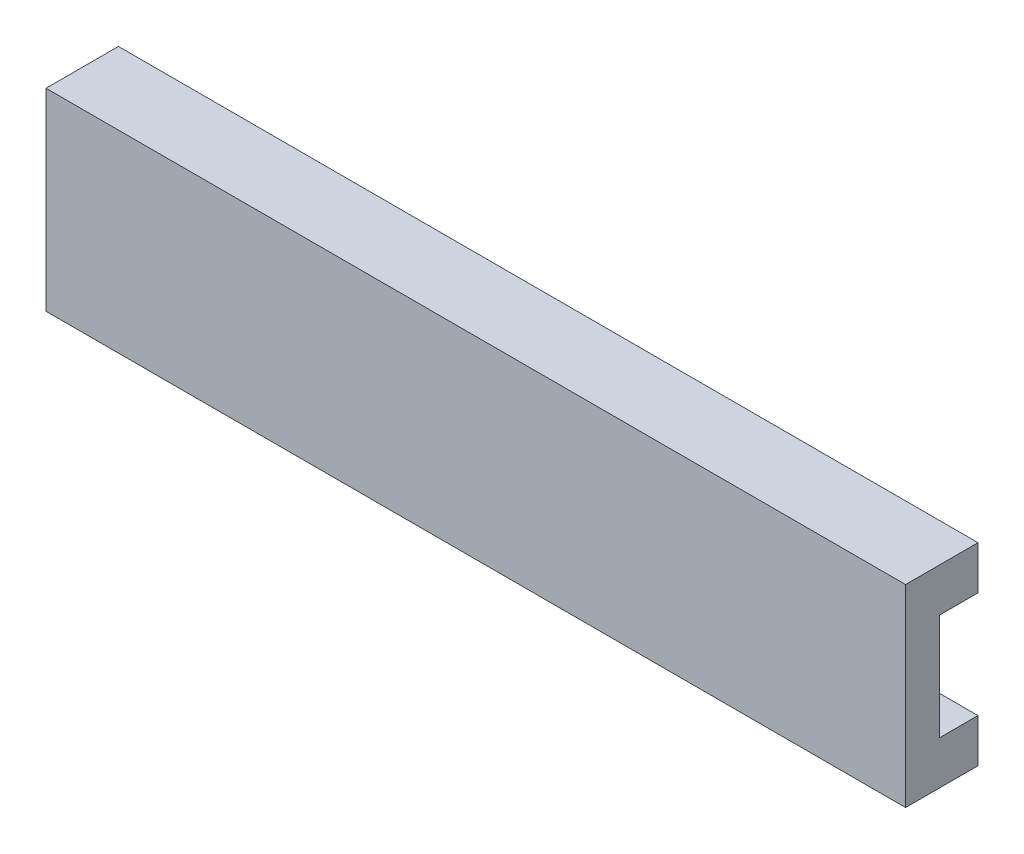
ISO-10303-21;
HEADER;
FILE_DESCRIPTION(('STEP AP214'),'2;1');
FILE_NAME('part.step','',(''),(''),'','','');
FILE_SCHEMA(('AUTOMOTIVE_DESIGN { 1 0 10303 214 1 1 1 1 }'));
ENDSEC;
DATA;
#1=APPLICATION_CONTEXT('core data for automotive mechanical design processes');
#2=APPLICATION_PROTOCOL_DEFINITION('international standard','automotive_design',2000,#1);
#3=PRODUCT_CONTEXT('',#1,'mechanical');
#4=PRODUCT('Part','Part','',(#3));
#5=PRODUCT_RELATED_PRODUCT_CATEGORY('part','',(#4));
#6=PRODUCT_DEFINITION_FORMATION('','',#4);
#7=PRODUCT_DEFINITION_CONTEXT('part definition',#1,'design');
#8=PRODUCT_DEFINITION('design','',#6,#7);
#9=PRODUCT_DEFINITION_SHAPE('','',#8);
#10=(LENGTH_UNIT() NAMED_UNIT(*) SI_UNIT(.MILLI.,.METRE.));
#11=(NAMED_UNIT(*) PLANE_ANGLE_UNIT() SI_UNIT($,.RADIAN.));
#12=(NAMED_UNIT(*) SI_UNIT($,.STERADIAN.) SOLID_ANGLE_UNIT());
#13=UNCERTAINTY_MEASURE_WITH_UNIT(LENGTH_MEASURE(1.E-05),#10,'distance_accuracy_value','');
#14=(GEOMETRIC_REPRESENTATION_CONTEXT(3) GLOBAL_UNCERTAINTY_ASSIGNED_CONTEXT((#13)) GLOBAL_UNIT_ASSIGNED_CONTEXT((#10,
#11,#12)) REPRESENTATION_CONTEXT('',''));
#15=CARTESIAN_POINT('',(0.,0.,0.));
#16=DIRECTION('',(0.,0.,1.));
#17=DIRECTION('',(1.,0.,0.));
#18=AXIS2_PLACEMENT_3D('',#15,#16,#17);
#19=CARTESIAN_POINT('',(-178.,0.,-15.));
#20=DIRECTION('',(0.,-1.,0.));
#21=DIRECTION('',(0.,0.,-1.));
#22=AXIS2_PLACEMENT_3D('',#19,#20,#21);
#23=PLANE('',#22);
#24=DIRECTION('',(0.,0.,-1.));
#25=VECTOR('',#24,1.);
#26=CARTESIAN_POINT('',(0.,0.,-15.));
#27=LINE('',#26,#25);
#28=CARTESIAN_POINT('',(0.,0.,0.));
#29=VERTEX_POINT('',#28);
#30=CARTESIAN_POINT('',(0.,0.,-15.));
#31=VERTEX_POINT('',#30);
#32=EDGE_CURVE('E130',#29,#31,#27,.T.);
#33=ORIENTED_EDGE('',*,*,#32,.F.);
#34=DIRECTION('',(1.,0.,0.));
#35=VECTOR('',#34,1.);
#36=CARTESIAN_POINT('',(-178.,0.,0.));
#37=LINE('',#36,#35);
#38=CARTESIAN_POINT('',(-178.,0.,0.));
#39=VERTEX_POINT('',#38);
#40=EDGE_CURVE('E11',#39,#29,#37,.T.);
#41=ORIENTED_EDGE('',*,*,#40,.F.);
#42=DIRECTION('',(0.,0.,-1.));
#43=VECTOR('',#42,1.);
#44=CARTESIAN_POINT('',(-178.,0.,-15.));
#45=LINE('',#44,#43);
#46=CARTESIAN_POINT('',(-178.,0.,-15.));
#47=VERTEX_POINT('',#46);
#48=EDGE_CURVE('E150',#39,#47,#45,.T.);
#49=ORIENTED_EDGE('',*,*,#48,.T.);
#50=DIRECTION('',(1.,0.,0.));
#51=VECTOR('',#50,1.);
#52=CARTESIAN_POINT('',(-178.,0.,-15.));
#53=LINE('',#52,#51);
#54=EDGE_CURVE('E36',#47,#31,#53,.T.);
#55=ORIENTED_EDGE('',*,*,#54,.T.);
#56=EDGE_LOOP('',(#33,#41,#49,#55));
#57=FACE_BOUND('',#56,.T.);
#58=ADVANCED_FACE('F33',(#57),#23,.T.);
#59=CARTESIAN_POINT('',(-178.,0.,0.));
#60=DIRECTION('',(0.,0.,1.));
#61=DIRECTION('',(1.,0.,0.));
#62=AXIS2_PLACEMENT_3D('',#59,#60,#61);
#63=PLANE('',#62);
#64=DIRECTION('',(0.,-1.,0.));
#65=VECTOR('',#64,1.);
#66=CARTESIAN_POINT('',(0.,0.,0.));
#67=LINE('',#66,#65);
#68=CARTESIAN_POINT('',(0.,40.,0.));
#69=VERTEX_POINT('',#68);
#70=EDGE_CURVE('E148',#69,#29,#67,.T.);
#71=ORIENTED_EDGE('',*,*,#70,.F.);
#72=DIRECTION('',(1.,0.,0.));
#73=VECTOR('',#72,1.);
#74=CARTESIAN_POINT('',(-178.,40.,0.));
#75=LINE('',#74,#73);
#76=CARTESIAN_POINT('',(-178.,40.,0.));
#77=VERTEX_POINT('',#76);
#78=EDGE_CURVE('E42',#77,#69,#75,.T.);
#79=ORIENTED_EDGE('',*,*,#78,.F.);
#80=DIRECTION('',(0.,-1.,0.));
#81=VECTOR('',#80,1.);
#82=CARTESIAN_POINT('',(-178.,0.,0.));
#83=LINE('',#82,#81);
#84=EDGE_CURVE('E120',#77,#39,#83,.T.);
#85=ORIENTED_EDGE('',*,*,#84,.T.);
#86=ORIENTED_EDGE('',*,*,#40,.T.);
#87=EDGE_LOOP('',(#71,#79,#85,#86));
#88=FACE_BOUND('',#87,.T.);
#89=ADVANCED_FACE('F162',(#88),#63,.T.);
#90=CARTESIAN_POINT('',(-178.,40.,0.));
#91=DIRECTION('',(0.,1.,0.));
#92=DIRECTION('',(0.,0.,1.));
#93=AXIS2_PLACEMENT_3D('',#90,#91,#92);
#94=PLANE('',#93);
#95=DIRECTION('',(0.,0.,1.));
#96=VECTOR('',#95,1.);
#97=CARTESIAN_POINT('',(0.,40.,0.));
#98=LINE('',#97,#96);
#99=CARTESIAN_POINT('',(0.,40.,-15.));
#100=VERTEX_POINT('',#99);
#101=EDGE_CURVE('E107',#100,#69,#98,.T.);
#102=ORIENTED_EDGE('',*,*,#101,.F.);
#103=DIRECTION('',(1.,0.,0.));
#104=VECTOR('',#103,1.);
#105=CARTESIAN_POINT('',(-178.,40.,-15.));
#106=LINE('',#105,#104);
#107=CARTESIAN_POINT('',(-178.,40.,-15.));
#108=VERTEX_POINT('',#107);
#109=EDGE_CURVE('E102',#108,#100,#106,.T.);
#110=ORIENTED_EDGE('',*,*,#109,.F.);
#111=DIRECTION('',(0.,0.,1.));
#112=VECTOR('',#111,1.);
#113=CARTESIAN_POINT('',(-178.,40.,0.));
#114=LINE('',#113,#112);
#115=EDGE_CURVE('E105',#108,#77,#114,.T.);
#116=ORIENTED_EDGE('',*,*,#115,.T.);
#117=ORIENTED_EDGE('',*,*,#78,.T.);
#118=EDGE_LOOP('',(#102,#110,#116,#117));
#119=FACE_BOUND('',#118,.T.);
#120=ADVANCED_FACE('F104',(#119),#94,.T.);
#121=CARTESIAN_POINT('',(-178.,40.,-15.));
#122=DIRECTION('',(0.,0.,-1.));
#123=DIRECTION('',(0.,1.,0.));
#124=AXIS2_PLACEMENT_3D('',#121,#122,#123);
#125=PLANE('',#124);
#126=DIRECTION('',(0.,1.,0.));
#127=VECTOR('',#126,1.);
#128=CARTESIAN_POINT('',(0.,40.,-15.));
#129=LINE('',#128,#127);
#130=CARTESIAN_POINT('',(0.,31.,-15.));
#131=VERTEX_POINT('',#130);
#132=EDGE_CURVE('E145',#131,#100,#129,.T.);
#133=ORIENTED_EDGE('',*,*,#132,.F.);
#134=DIRECTION('',(1.,0.,0.));
#135=VECTOR('',#134,1.);
#136=CARTESIAN_POINT('',(-178.,31.,-15.));
#137=LINE('',#136,#135);
#138=CARTESIAN_POINT('',(-178.,31.,-15.));
#139=VERTEX_POINT('',#138);
#140=EDGE_CURVE('E112',#139,#131,#137,.T.);
#141=ORIENTED_EDGE('',*,*,#140,.F.);
#142=DIRECTION('',(0.,1.,0.));
#143=VECTOR('',#142,1.);
#144=CARTESIAN_POINT('',(-178.,40.,-15.));
#145=LINE('',#144,#143);
#146=EDGE_CURVE('E118',#139,#108,#145,.T.);
#147=ORIENTED_EDGE('',*,*,#146,.T.);
#148=ORIENTED_EDGE('',*,*,#109,.T.);
#149=EDGE_LOOP('',(#133,#141,#147,#148));
#150=FACE_BOUND('',#149,.T.);
#151=ADVANCED_FACE('F122',(#150),#125,.T.);
#152=CARTESIAN_POINT('',(-178.,31.,-15.));
#153=DIRECTION('',(0.,-1.,0.));
#154=DIRECTION('',(0.,0.,-1.));
#155=AXIS2_PLACEMENT_3D('',#152,#153,#154);
#156=PLANE('',#155);
#157=DIRECTION('',(0.,0.,-1.));
#158=VECTOR('',#157,1.);
#159=CARTESIAN_POINT('',(0.,31.,-15.));
#160=LINE('',#159,#158);
#161=CARTESIAN_POINT('',(0.,31.,-7.));
#162=VERTEX_POINT('',#161);
#163=EDGE_CURVE('E142',#162,#131,#160,.T.);
#164=ORIENTED_EDGE('',*,*,#163,.F.);
#165=DIRECTION('',(1.,0.,0.));
#166=VECTOR('',#165,1.);
#167=CARTESIAN_POINT('',(-178.,31.,-7.));
#168=LINE('',#167,#166);
#169=CARTESIAN_POINT('',(-178.,31.,-7.));
#170=VERTEX_POINT('',#169);
#171=EDGE_CURVE('E154',#170,#162,#168,.T.);
#172=ORIENTED_EDGE('',*,*,#171,.F.);
#173=DIRECTION('',(0.,0.,-1.));
#174=VECTOR('',#173,1.);
#175=CARTESIAN_POINT('',(-178.,31.,-15.));
#176=LINE('',#175,#174);
#177=EDGE_CURVE('E123',#170,#139,#176,.T.);
#178=ORIENTED_EDGE('',*,*,#177,.T.);
#179=ORIENTED_EDGE('',*,*,#140,.T.);
#180=EDGE_LOOP('',(#164,#172,#178,#179));
#181=FACE_BOUND('',#180,.T.);
#182=ADVANCED_FACE('F175',(#181),#156,.T.);
#183=CARTESIAN_POINT('',(-178.,31.,-7.));
#184=DIRECTION('',(0.,0.,-1.));
#185=DIRECTION('',(0.,1.,0.));
#186=AXIS2_PLACEMENT_3D('',#183,#184,#185);
#187=PLANE('',#186);
#188=DIRECTION('',(0.,1.,0.));
#189=VECTOR('',#188,1.);
#190=CARTESIAN_POINT('',(0.,31.,-7.));
#191=LINE('',#190,#189);
#192=CARTESIAN_POINT('',(0.,9.,-7.));
#193=VERTEX_POINT('',#192);
#194=EDGE_CURVE('E139',#193,#162,#191,.T.);
#195=ORIENTED_EDGE('',*,*,#194,.F.);
#196=DIRECTION('',(1.,0.,0.));
#197=VECTOR('',#196,1.);
#198=CARTESIAN_POINT('',(-178.,9.,-7.));
#199=LINE('',#198,#197);
#200=CARTESIAN_POINT('',(-178.,9.,-7.));
#201=VERTEX_POINT('',#200);
#202=EDGE_CURVE('E156',#201,#193,#199,.T.);
#203=ORIENTED_EDGE('',*,*,#202,.F.);
#204=DIRECTION('',(0.,1.,0.));
#205=VECTOR('',#204,1.);
#206=CARTESIAN_POINT('',(-178.,31.,-7.));
#207=LINE('',#206,#205);
#208=EDGE_CURVE('E125',#201,#170,#207,.T.);
#209=ORIENTED_EDGE('',*,*,#208,.T.);
#210=ORIENTED_EDGE('',*,*,#171,.T.);
#211=EDGE_LOOP('',(#195,#203,#209,#210));
#212=FACE_BOUND('',#211,.T.);
#213=ADVANCED_FACE('F178',(#212),#187,.T.);
#214=CARTESIAN_POINT('',(-178.,9.,-7.));
#215=DIRECTION('',(0.,1.,0.));
#216=DIRECTION('',(0.,0.,1.));
#217=AXIS2_PLACEMENT_3D('',#214,#215,#216);
#218=PLANE('',#217);
#219=DIRECTION('',(0.,0.,1.));
#220=VECTOR('',#219,1.);
#221=CARTESIAN_POINT('',(0.,9.,-7.));
#222=LINE('',#221,#220);
#223=CARTESIAN_POINT('',(0.,9.,-15.));
#224=VERTEX_POINT('',#223);
#225=EDGE_CURVE('E136',#224,#193,#222,.T.);
#226=ORIENTED_EDGE('',*,*,#225,.F.);
#227=DIRECTION('',(1.,0.,0.));
#228=VECTOR('',#227,1.);
#229=CARTESIAN_POINT('',(-178.,9.,-15.));
#230=LINE('',#229,#228);
#231=CARTESIAN_POINT('',(-178.,9.,-15.));
#232=VERTEX_POINT('',#231);
#233=EDGE_CURVE('E157',#232,#224,#230,.T.);
#234=ORIENTED_EDGE('',*,*,#233,.F.);
#235=DIRECTION('',(0.,0.,1.));
#236=VECTOR('',#235,1.);
#237=CARTESIAN_POINT('',(-178.,9.,-7.));
#238=LINE('',#237,#236);
#239=EDGE_CURVE('E253',#232,#201,#238,.T.);
#240=ORIENTED_EDGE('',*,*,#239,.T.);
#241=ORIENTED_EDGE('',*,*,#202,.T.);
#242=EDGE_LOOP('',(#226,#234,#240,#241));
#243=FACE_BOUND('',#242,.T.);
#244=ADVANCED_FACE('F182',(#243),#218,.T.);
#245=CARTESIAN_POINT('',(-178.,9.,-15.));
#246=DIRECTION('',(0.,0.,-1.));
#247=DIRECTION('',(-1.,0.,0.));
#248=AXIS2_PLACEMENT_3D('',#245,#246,#247);
#249=PLANE('',#248);
#250=DIRECTION('',(0.,1.,0.));
#251=VECTOR('',#250,1.);
#252=CARTESIAN_POINT('',(0.,9.,-15.));
#253=LINE('',#252,#251);
#254=EDGE_CURVE('E133',#31,#224,#253,.T.);
#255=ORIENTED_EDGE('',*,*,#254,.F.);
#256=ORIENTED_EDGE('',*,*,#54,.F.);
#257=DIRECTION('',(0.,1.,0.));
#258=VECTOR('',#257,1.);
#259=CARTESIAN_POINT('',(-178.,9.,-15.));
#260=LINE('',#259,#258);
#261=EDGE_CURVE('E254',#47,#232,#260,.T.);
#262=ORIENTED_EDGE('',*,*,#261,.T.);
#263=ORIENTED_EDGE('',*,*,#233,.T.);
#264=EDGE_LOOP('',(#255,#256,#262,#263));
#265=FACE_BOUND('',#264,.T.);
#266=ADVANCED_FACE('F159',(#265),#249,.T.);
#267=CARTESIAN_POINT('',(-178.,0.,0.));
#268=DIRECTION('',(-1.,0.,0.));
#269=DIRECTION('',(0.,0.,1.));
#270=AXIS2_PLACEMENT_3D('',#267,#268,#269);
#271=PLANE('',#270);
#272=ORIENTED_EDGE('',*,*,#48,.F.);
#273=ORIENTED_EDGE('',*,*,#84,.F.);
#274=ORIENTED_EDGE('',*,*,#115,.F.);
#275=ORIENTED_EDGE('',*,*,#146,.F.);
#276=ORIENTED_EDGE('',*,*,#177,.F.);
#277=ORIENTED_EDGE('',*,*,#208,.F.);
#278=ORIENTED_EDGE('',*,*,#239,.F.);
#279=ORIENTED_EDGE('',*,*,#261,.F.);
#280=EDGE_LOOP('',(#272,#273,#274,#275,#276,#277,#278,#279));
#281=FACE_BOUND('',#280,.T.);
#282=ADVANCED_FACE('F116',(#281),#271,.T.);
#283=CARTESIAN_POINT('',(0.,0.,0.));
#284=DIRECTION('',(-1.,0.,0.));
#285=DIRECTION('',(0.,0.,1.));
#286=AXIS2_PLACEMENT_3D('',#283,#284,#285);
#287=PLANE('',#286);
#288=ORIENTED_EDGE('',*,*,#32,.T.);
#289=ORIENTED_EDGE('',*,*,#254,.T.);
#290=ORIENTED_EDGE('',*,*,#225,.T.);
#291=ORIENTED_EDGE('',*,*,#194,.T.);
#292=ORIENTED_EDGE('',*,*,#163,.T.);
#293=ORIENTED_EDGE('',*,*,#132,.T.);
#294=ORIENTED_EDGE('',*,*,#101,.T.);
#295=ORIENTED_EDGE('',*,*,#70,.T.);
#296=EDGE_LOOP('',(#288,#289,#290,#291,#292,#293,#294,#295));
#297=FACE_BOUND('',#296,.T.);
#298=ADVANCED_FACE('F161',(#297),#287,.F.);
#299=CLOSED_SHELL('',(#58,#89,#120,#151,#182,#213,#244,#266,#282,#298));
#300=MANIFOLD_SOLID_BREP('B2',#299);
#301=ADVANCED_BREP_SHAPE_REPRESENTATION('',(#18,#300),#14);
#302=SHAPE_DEFINITION_REPRESENTATION(#9,#301);
ENDSEC;
END-ISO-10303-21;
